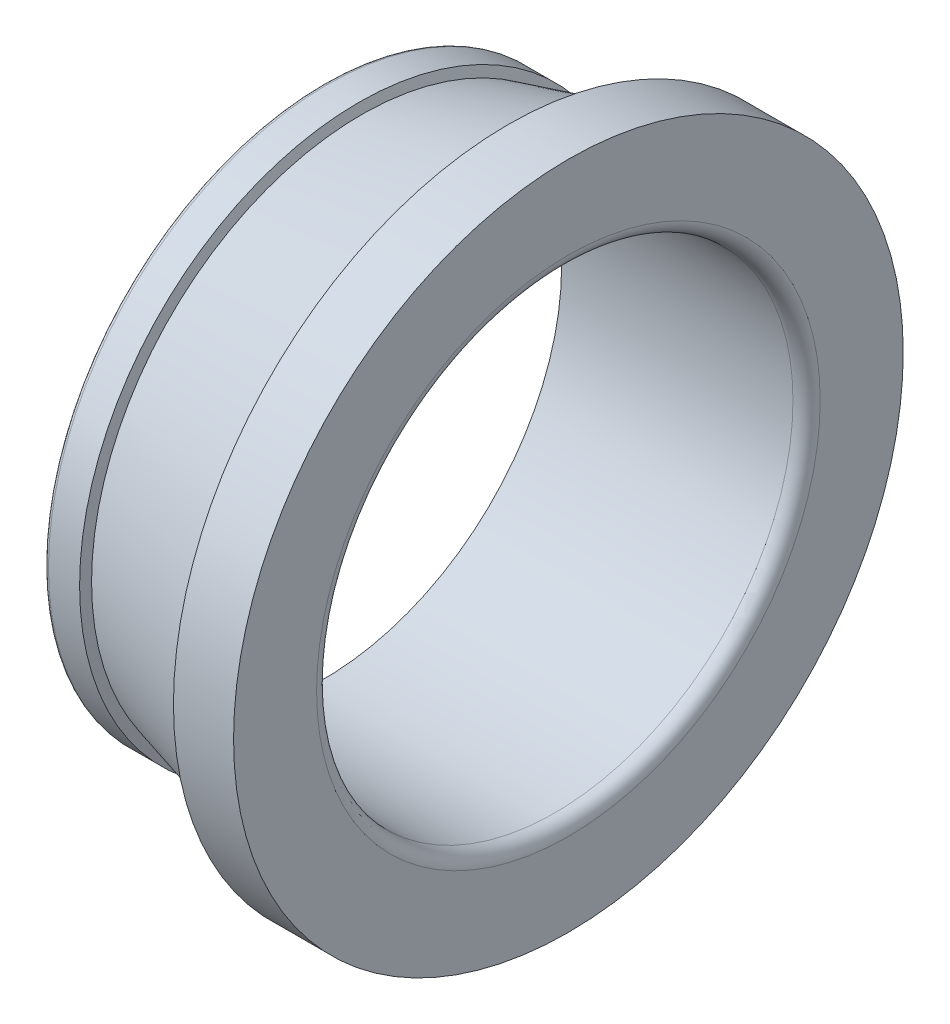
ISO-10303-21;
HEADER;
FILE_DESCRIPTION(('STEP AP214'),'2;1');
FILE_NAME('part.step','',(''),(''),'','','');
FILE_SCHEMA(('AUTOMOTIVE_DESIGN { 1 0 10303 214 1 1 1 1 }'));
ENDSEC;
DATA;
#1=APPLICATION_CONTEXT('core data for automotive mechanical design processes');
#2=APPLICATION_PROTOCOL_DEFINITION('international standard','automotive_design',2000,#1);
#3=PRODUCT_CONTEXT('',#1,'mechanical');
#4=PRODUCT('Part','Part','',(#3));
#5=PRODUCT_RELATED_PRODUCT_CATEGORY('part','',(#4));
#6=PRODUCT_DEFINITION_FORMATION('','',#4);
#7=PRODUCT_DEFINITION_CONTEXT('part definition',#1,'design');
#8=PRODUCT_DEFINITION('design','',#6,#7);
#9=PRODUCT_DEFINITION_SHAPE('','',#8);
#10=(LENGTH_UNIT() NAMED_UNIT(*) SI_UNIT(.MILLI.,.METRE.));
#11=(NAMED_UNIT(*) PLANE_ANGLE_UNIT() SI_UNIT($,.RADIAN.));
#12=(NAMED_UNIT(*) SI_UNIT($,.STERADIAN.) SOLID_ANGLE_UNIT());
#13=UNCERTAINTY_MEASURE_WITH_UNIT(LENGTH_MEASURE(1.E-05),#10,'distance_accuracy_value','');
#14=(GEOMETRIC_REPRESENTATION_CONTEXT(3) GLOBAL_UNCERTAINTY_ASSIGNED_CONTEXT((#13)) GLOBAL_UNIT_ASSIGNED_CONTEXT((#10,
#11,#12)) REPRESENTATION_CONTEXT('',''));
#15=CARTESIAN_POINT('',(0.,0.,0.));
#16=DIRECTION('',(0.,0.,1.));
#17=DIRECTION('',(1.,0.,0.));
#18=AXIS2_PLACEMENT_3D('',#15,#16,#17);
#19=CARTESIAN_POINT('',(0.,20.2,0.));
#20=DIRECTION('',(1.,0.,0.));
#21=DIRECTION('',(0.,0.,-1.));
#22=AXIS2_PLACEMENT_3D('',#19,#20,#21);
#23=PLANE('',#22);
#24=CARTESIAN_POINT('',(0.,0.,0.));
#25=DIRECTION('',(-1.,0.,0.));
#26=DIRECTION('',(0.,0.,1.));
#27=AXIS2_PLACEMENT_3D('',#24,#25,#26);
#28=CIRCLE('',#27,17.5);
#29=CARTESIAN_POINT('',(0.,0.,17.5));
#30=VERTEX_POINT('',#29);
#31=EDGE_CURVE('E10',#30,#30,#28,.T.);
#32=ORIENTED_EDGE('',*,*,#31,.F.);
#33=EDGE_LOOP('',(#32));
#34=FACE_BOUND('',#33,.T.);
#35=CARTESIAN_POINT('',(0.,0.,0.));
#36=DIRECTION('',(-1.,0.,0.));
#37=DIRECTION('',(0.,0.,1.));
#38=AXIS2_PLACEMENT_3D('',#35,#36,#37);
#39=CIRCLE('',#38,20.2);
#40=CARTESIAN_POINT('',(0.,0.,20.2));
#41=VERTEX_POINT('',#40);
#42=EDGE_CURVE('E64',#41,#41,#39,.T.);
#43=ORIENTED_EDGE('',*,*,#42,.T.);
#44=EDGE_LOOP('',(#43));
#45=FACE_BOUND('',#44,.T.);
#46=ADVANCED_FACE('F14',(#34,#45),#23,.F.);
#47=CARTESIAN_POINT('',(0.,0.,0.));
#48=DIRECTION('',(-1.,0.,0.));
#49=DIRECTION('',(0.,0.,1.));
#50=AXIS2_PLACEMENT_3D('',#47,#48,#49);
#51=CYLINDRICAL_SURFACE('',#50,17.5);
#52=CARTESIAN_POINT('',(17.,0.,0.));
#53=DIRECTION('',(-1.,0.,0.));
#54=DIRECTION('',(0.,0.,1.));
#55=AXIS2_PLACEMENT_3D('',#52,#53,#54);
#56=CIRCLE('',#55,17.5);
#57=CARTESIAN_POINT('',(17.,0.,17.5));
#58=VERTEX_POINT('',#57);
#59=EDGE_CURVE('E21',#58,#58,#56,.T.);
#60=ORIENTED_EDGE('',*,*,#59,.F.);
#61=EDGE_LOOP('',(#60));
#62=FACE_BOUND('',#61,.T.);
#63=ORIENTED_EDGE('',*,*,#31,.T.);
#64=EDGE_LOOP('',(#63));
#65=FACE_BOUND('',#64,.T.);
#66=ADVANCED_FACE('F89',(#62,#65),#51,.F.);
#67=CARTESIAN_POINT('',(17.,0.,0.));
#68=DIRECTION('',(-1.,0.,0.));
#69=DIRECTION('',(0.,0.,1.));
#70=AXIS2_PLACEMENT_3D('',#67,#68,#69);
#71=TOROIDAL_SURFACE('',#70,18.5,1.);
#72=CARTESIAN_POINT('',(18.,0.,0.));
#73=DIRECTION('',(-1.,0.,0.));
#74=DIRECTION('',(0.,0.,1.));
#75=AXIS2_PLACEMENT_3D('',#72,#73,#74);
#76=CIRCLE('',#75,18.5);
#77=CARTESIAN_POINT('',(18.,0.,18.5));
#78=VERTEX_POINT('',#77);
#79=EDGE_CURVE('E30',#78,#78,#76,.T.);
#80=ORIENTED_EDGE('',*,*,#79,.F.);
#81=EDGE_LOOP('',(#80));
#82=FACE_BOUND('',#81,.T.);
#83=ORIENTED_EDGE('',*,*,#59,.T.);
#84=EDGE_LOOP('',(#83));
#85=FACE_BOUND('',#84,.T.);
#86=ADVANCED_FACE('F94',(#82,#85),#71,.T.);
#87=CARTESIAN_POINT('',(18.,18.5,0.));
#88=DIRECTION('',(-1.,0.,0.));
#89=DIRECTION('',(0.,0.,1.));
#90=AXIS2_PLACEMENT_3D('',#87,#88,#89);
#91=PLANE('',#90);
#92=CARTESIAN_POINT('',(18.,0.,0.));
#93=DIRECTION('',(-1.,0.,0.));
#94=DIRECTION('',(0.,0.,1.));
#95=AXIS2_PLACEMENT_3D('',#92,#93,#94);
#96=CIRCLE('',#95,24.6);
#97=CARTESIAN_POINT('',(18.,0.,24.6));
#98=VERTEX_POINT('',#97);
#99=EDGE_CURVE('E38',#98,#98,#96,.T.);
#100=ORIENTED_EDGE('',*,*,#99,.F.);
#101=EDGE_LOOP('',(#100));
#102=FACE_BOUND('',#101,.T.);
#103=ORIENTED_EDGE('',*,*,#79,.T.);
#104=EDGE_LOOP('',(#103));
#105=FACE_BOUND('',#104,.T.);
#106=ADVANCED_FACE('F99',(#102,#105),#91,.F.);
#107=CARTESIAN_POINT('',(0.,0.,0.));
#108=DIRECTION('',(-1.,0.,0.));
#109=DIRECTION('',(0.,0.,1.));
#110=AXIS2_PLACEMENT_3D('',#107,#108,#109);
#111=CYLINDRICAL_SURFACE('',#110,24.6);
#112=CARTESIAN_POINT('',(13.5826488888889,0.,0.));
#113=DIRECTION('',(-1.,0.,0.));
#114=DIRECTION('',(0.,0.,1.));
#115=AXIS2_PLACEMENT_3D('',#112,#113,#114);
#116=CIRCLE('',#115,24.6);
#117=CARTESIAN_POINT('',(13.5826488888889,0.,24.6));
#118=VERTEX_POINT('',#117);
#119=EDGE_CURVE('E44',#118,#118,#116,.T.);
#120=ORIENTED_EDGE('',*,*,#119,.F.);
#121=EDGE_LOOP('',(#120));
#122=FACE_BOUND('',#121,.T.);
#123=ORIENTED_EDGE('',*,*,#99,.T.);
#124=EDGE_LOOP('',(#123));
#125=FACE_BOUND('',#124,.T.);
#126=ADVANCED_FACE('F105',(#122,#125),#111,.T.);
#127=CARTESIAN_POINT('',(13.5826488888889,0.,0.));
#128=DIRECTION('',(-1.,0.,0.));
#129=DIRECTION('',(0.,0.,1.));
#130=AXIS2_PLACEMENT_3D('',#127,#128,#129);
#131=CONICAL_SURFACE('',#130,24.6,1.27323460205709);
#132=CARTESIAN_POINT('',(14.1132687945966,0.,0.));
#133=DIRECTION('',(-1.,0.,0.));
#134=DIRECTION('',(0.,0.,1.));
#135=AXIS2_PLACEMENT_3D('',#132,#133,#134);
#136=CIRCLE('',#135,22.8697176987792);
#137=CARTESIAN_POINT('',(14.1132687945966,0.,22.8697176987792));
#138=VERTEX_POINT('',#137);
#139=EDGE_CURVE('E48',#138,#138,#136,.T.);
#140=ORIENTED_EDGE('',*,*,#139,.F.);
#141=EDGE_LOOP('',(#140));
#142=FACE_BOUND('',#141,.T.);
#143=ORIENTED_EDGE('',*,*,#119,.T.);
#144=EDGE_LOOP('',(#143));
#145=FACE_BOUND('',#144,.T.);
#146=ADVANCED_FACE('F109',(#142,#145),#131,.F.);
#147=CARTESIAN_POINT('',(14.1132687945966,0.,0.));
#148=DIRECTION('',(1.,0.,0.));
#149=DIRECTION('',(0.,0.,-1.));
#150=AXIS2_PLACEMENT_3D('',#147,#148,#149);
#151=CONICAL_SURFACE('',#150,22.8697176987792,0.262655139697919);
#152=CARTESIAN_POINT('',(2.79332759164896,0.,0.));
#153=DIRECTION('',(-1.,0.,0.));
#154=DIRECTION('',(0.,0.,1.));
#155=AXIS2_PLACEMENT_3D('',#152,#153,#154);
#156=CIRCLE('',#155,19.82616365042);
#157=CARTESIAN_POINT('',(2.79332759164896,0.,19.82616365042));
#158=VERTEX_POINT('',#157);
#159=EDGE_CURVE('E52',#158,#158,#156,.T.);
#160=ORIENTED_EDGE('',*,*,#159,.F.);
#161=EDGE_LOOP('',(#160));
#162=FACE_BOUND('',#161,.T.);
#163=ORIENTED_EDGE('',*,*,#139,.T.);
#164=EDGE_LOOP('',(#163));
#165=FACE_BOUND('',#164,.T.);
#166=ADVANCED_FACE('F85',(#162,#165),#151,.T.);
#167=CARTESIAN_POINT('',(2.79332759164896,0.,0.));
#168=DIRECTION('',(-1.,0.,0.));
#169=DIRECTION('',(0.,0.,1.));
#170=AXIS2_PLACEMENT_3D('',#167,#168,#169);
#171=CONICAL_SURFACE('',#170,19.82616365042,1.27323460205709);
#172=CARTESIAN_POINT('',(2.58668444444444,0.,0.));
#173=DIRECTION('',(-1.,0.,0.));
#174=DIRECTION('',(0.,0.,1.));
#175=AXIS2_PLACEMENT_3D('',#172,#173,#174);
#176=CIRCLE('',#175,20.5);
#177=CARTESIAN_POINT('',(2.58668444444444,0.,20.5));
#178=VERTEX_POINT('',#177);
#179=EDGE_CURVE('E56',#178,#178,#176,.T.);
#180=ORIENTED_EDGE('',*,*,#179,.F.);
#181=EDGE_LOOP('',(#180));
#182=FACE_BOUND('',#181,.T.);
#183=ORIENTED_EDGE('',*,*,#159,.T.);
#184=EDGE_LOOP('',(#183));
#185=FACE_BOUND('',#184,.T.);
#186=ADVANCED_FACE('F78',(#182,#185),#171,.T.);
#187=CARTESIAN_POINT('',(0.,0.,0.));
#188=DIRECTION('',(-1.,0.,0.));
#189=DIRECTION('',(0.,0.,1.));
#190=AXIS2_PLACEMENT_3D('',#187,#188,#189);
#191=CYLINDRICAL_SURFACE('',#190,20.5);
#192=ORIENTED_EDGE('',*,*,#179,.T.);
#193=EDGE_LOOP('',(#192));
#194=FACE_BOUND('',#193,.T.);
#195=CARTESIAN_POINT('',(0.3,0.,0.));
#196=DIRECTION('',(-1.,0.,0.));
#197=DIRECTION('',(0.,0.,1.));
#198=AXIS2_PLACEMENT_3D('',#195,#196,#197);
#199=CIRCLE('',#198,20.5);
#200=CARTESIAN_POINT('',(0.3,0.,20.5));
#201=VERTEX_POINT('',#200);
#202=EDGE_CURVE('E60',#201,#201,#199,.T.);
#203=ORIENTED_EDGE('',*,*,#202,.F.);
#204=EDGE_LOOP('',(#203));
#205=FACE_BOUND('',#204,.T.);
#206=ADVANCED_FACE('F73',(#194,#205),#191,.T.);
#207=CARTESIAN_POINT('',(0.3,0.,0.));
#208=DIRECTION('',(-1.,0.,0.));
#209=DIRECTION('',(0.,0.,1.));
#210=AXIS2_PLACEMENT_3D('',#207,#208,#209);
#211=TOROIDAL_SURFACE('',#210,20.2,0.3);
#212=ORIENTED_EDGE('',*,*,#42,.F.);
#213=EDGE_LOOP('',(#212));
#214=FACE_BOUND('',#213,.T.);
#215=ORIENTED_EDGE('',*,*,#202,.T.);
#216=EDGE_LOOP('',(#215));
#217=FACE_BOUND('',#216,.T.);
#218=ADVANCED_FACE('F70',(#214,#217),#211,.T.);
#219=CLOSED_SHELL('',(#46,#66,#86,#106,#126,#146,#166,#186,#206,#218));
#220=MANIFOLD_SOLID_BREP('B1',#219);
#221=ADVANCED_BREP_SHAPE_REPRESENTATION('',(#18,#220),#14);
#222=SHAPE_DEFINITION_REPRESENTATION(#9,#221);
ENDSEC;
END-ISO-10303-21;
